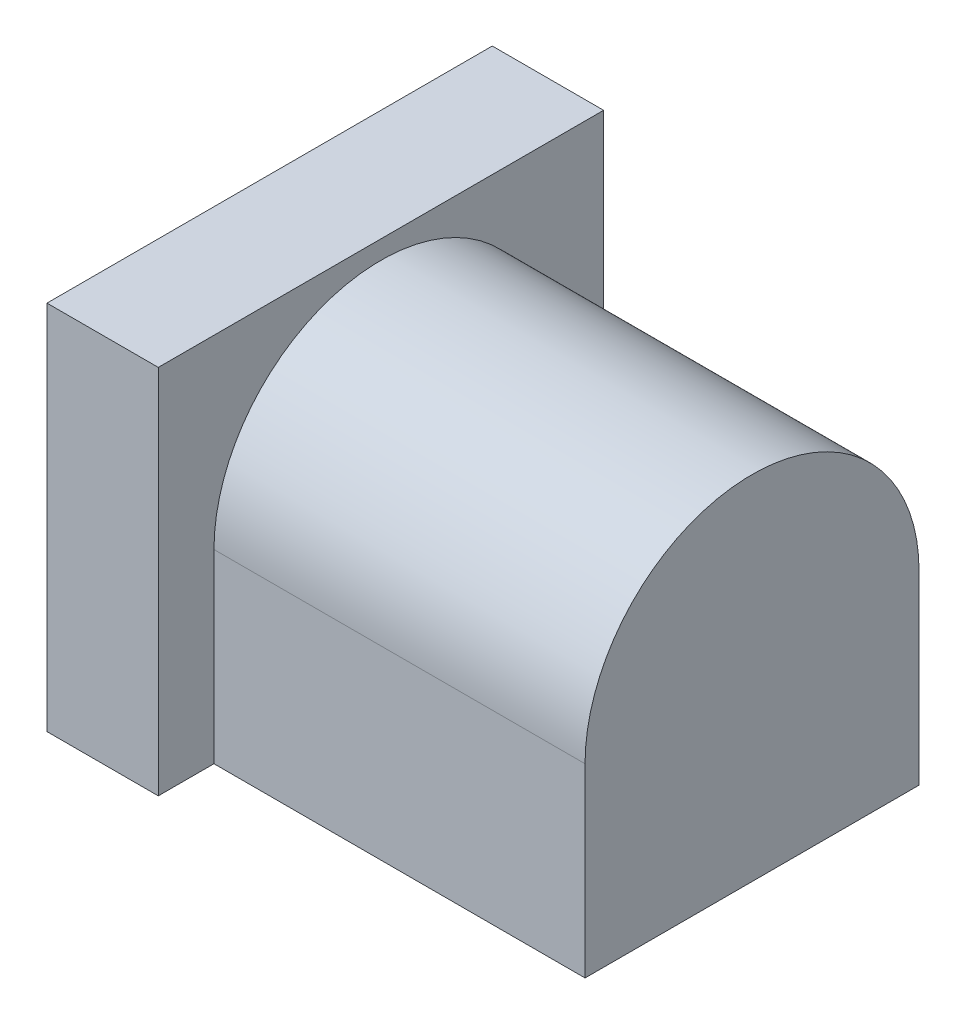
ISO-10303-21;
HEADER;
FILE_DESCRIPTION(('STEP AP214'),'2;1');
FILE_NAME('part.step','',(''),(''),'','','');
FILE_SCHEMA(('AUTOMOTIVE_DESIGN { 1 0 10303 214 1 1 1 1 }'));
ENDSEC;
DATA;
#1=APPLICATION_CONTEXT('core data for automotive mechanical design processes');
#2=APPLICATION_PROTOCOL_DEFINITION('international standard','automotive_design',2000,#1);
#3=PRODUCT_CONTEXT('',#1,'mechanical');
#4=PRODUCT('Part','Part','',(#3));
#5=PRODUCT_RELATED_PRODUCT_CATEGORY('part','',(#4));
#6=PRODUCT_DEFINITION_FORMATION('','',#4);
#7=PRODUCT_DEFINITION_CONTEXT('part definition',#1,'design');
#8=PRODUCT_DEFINITION('design','',#6,#7);
#9=PRODUCT_DEFINITION_SHAPE('','',#8);
#10=(LENGTH_UNIT() NAMED_UNIT(*) SI_UNIT(.MILLI.,.METRE.));
#11=(NAMED_UNIT(*) PLANE_ANGLE_UNIT() SI_UNIT($,.RADIAN.));
#12=(NAMED_UNIT(*) SI_UNIT($,.STERADIAN.) SOLID_ANGLE_UNIT());
#13=UNCERTAINTY_MEASURE_WITH_UNIT(LENGTH_MEASURE(1.E-05),#10,'distance_accuracy_value','');
#14=(GEOMETRIC_REPRESENTATION_CONTEXT(3) GLOBAL_UNCERTAINTY_ASSIGNED_CONTEXT((#13)) GLOBAL_UNIT_ASSIGNED_CONTEXT((#10,
#11,#12)) REPRESENTATION_CONTEXT('',''));
#15=CARTESIAN_POINT('',(0.,0.,0.));
#16=DIRECTION('',(0.,0.,1.));
#17=DIRECTION('',(1.,0.,0.));
#18=AXIS2_PLACEMENT_3D('',#15,#16,#17);
#19=CARTESIAN_POINT('',(9.,-38.179278243511,0.));
#20=DIRECTION('',(-1.,0.,0.));
#21=DIRECTION('',(0.,0.,1.));
#22=AXIS2_PLACEMENT_3D('',#19,#20,#21);
#23=PLANE('',#22);
#24=CARTESIAN_POINT('',(9.,-38.179278243511,0.));
#25=DIRECTION('',(-1.,0.,0.));
#26=DIRECTION('',(0.,0.,1.));
#27=AXIS2_PLACEMENT_3D('',#24,#25,#26);
#28=CIRCLE('',#27,3.);
#29=CARTESIAN_POINT('',(9.,-38.179278243511,2.99999999999999));
#30=VERTEX_POINT('',#29);
#31=EDGE_CURVE('E153',#30,#30,#28,.T.);
#32=ORIENTED_EDGE('',*,*,#31,.T.);
#33=EDGE_LOOP('',(#32));
#34=FACE_BOUND('',#33,.T.);
#35=CARTESIAN_POINT('',(9.,-38.179278243511,0.));
#36=DIRECTION('',(-1.,0.,0.));
#37=DIRECTION('',(0.,0.,1.));
#38=AXIS2_PLACEMENT_3D('',#35,#36,#37);
#39=CIRCLE('',#38,0.5);
#40=CARTESIAN_POINT('',(9.,-38.179278243511,0.49999999999999));
#41=VERTEX_POINT('',#40);
#42=EDGE_CURVE('E160',#41,#41,#39,.T.);
#43=ORIENTED_EDGE('',*,*,#42,.F.);
#44=EDGE_LOOP('',(#43));
#45=FACE_BOUND('',#44,.T.);
#46=ADVANCED_FACE('F34',(#34,#45),#23,.T.);
#47=CARTESIAN_POINT('',(10.,-43.179278243511,4.49999999999998));
#48=DIRECTION('',(0.,0.,-1.));
#49=DIRECTION('',(0.,1.,0.));
#50=AXIS2_PLACEMENT_3D('',#47,#48,#49);
#51=PLANE('',#50);
#52=DIRECTION('',(0.,-1.,0.));
#53=VECTOR('',#52,1.);
#54=CARTESIAN_POINT('',(0.,-43.179278243511,4.49999999999998));
#55=LINE('',#54,#53);
#56=CARTESIAN_POINT('',(0.,-38.179278243511,4.49999999999999));
#57=VERTEX_POINT('',#56);
#58=CARTESIAN_POINT('',(0.,-43.179278243511,4.49999999999999));
#59=VERTEX_POINT('',#58);
#60=EDGE_CURVE('E122',#57,#59,#55,.T.);
#61=ORIENTED_EDGE('',*,*,#60,.T.);
#62=DIRECTION('',(-1.,0.,0.));
#63=VECTOR('',#62,1.);
#64=CARTESIAN_POINT('',(10.,-43.179278243511,4.49999999999998));
#65=LINE('',#64,#63);
#66=CARTESIAN_POINT('',(10.,-43.179278243511,4.49999999999998));
#67=VERTEX_POINT('',#66);
#68=EDGE_CURVE('E43',#67,#59,#65,.T.);
#69=ORIENTED_EDGE('',*,*,#68,.F.);
#70=DIRECTION('',(0.,-1.,0.));
#71=VECTOR('',#70,1.);
#72=CARTESIAN_POINT('',(10.,-43.179278243511,4.49999999999998));
#73=LINE('',#72,#71);
#74=CARTESIAN_POINT('',(10.,-38.179278243511,4.49999999999999));
#75=VERTEX_POINT('',#74);
#76=EDGE_CURVE('E329',#75,#67,#73,.T.);
#77=ORIENTED_EDGE('',*,*,#76,.F.);
#78=DIRECTION('',(-1.,0.,0.));
#79=VECTOR('',#78,1.);
#80=CARTESIAN_POINT('',(10.,-38.179278243511,4.49999999999999));
#81=LINE('',#80,#79);
#82=EDGE_CURVE('E313',#75,#57,#81,.T.);
#83=ORIENTED_EDGE('',*,*,#82,.T.);
#84=EDGE_LOOP('',(#61,#69,#77,#83));
#85=FACE_BOUND('',#84,.T.);
#86=ADVANCED_FACE('F174',(#85),#51,.F.);
#87=CARTESIAN_POINT('',(10.,-43.179278243511,4.49999999999998));
#88=DIRECTION('',(0.,1.,0.));
#89=DIRECTION('',(0.,0.,1.));
#90=AXIS2_PLACEMENT_3D('',#87,#88,#89);
#91=PLANE('',#90);
#92=ORIENTED_EDGE('',*,*,#68,.T.);
#93=DIRECTION('',(0.,0.,1.));
#94=VECTOR('',#93,1.);
#95=CARTESIAN_POINT('',(0.,-43.179278243511,-6.));
#96=LINE('',#95,#94);
#97=CARTESIAN_POINT('',(0.,-43.179278243511,6.));
#98=VERTEX_POINT('',#97);
#99=EDGE_CURVE('E134',#59,#98,#96,.T.);
#100=ORIENTED_EDGE('',*,*,#99,.T.);
#101=DIRECTION('',(1.,0.,0.));
#102=VECTOR('',#101,1.);
#103=CARTESIAN_POINT('',(-3.,-43.179278243511,6.));
#104=LINE('',#103,#102);
#105=CARTESIAN_POINT('',(-3.,-43.179278243511,6.));
#106=VERTEX_POINT('',#105);
#107=EDGE_CURVE('E104',#106,#98,#104,.T.);
#108=ORIENTED_EDGE('',*,*,#107,.F.);
#109=DIRECTION('',(0.,0.,1.));
#110=VECTOR('',#109,1.);
#111=CARTESIAN_POINT('',(-3.,-43.179278243511,-6.));
#112=LINE('',#111,#110);
#113=CARTESIAN_POINT('',(-3.,-43.179278243511,-6.));
#114=VERTEX_POINT('',#113);
#115=EDGE_CURVE('E95',#114,#106,#112,.T.);
#116=ORIENTED_EDGE('',*,*,#115,.F.);
#117=DIRECTION('',(1.,0.,0.));
#118=VECTOR('',#117,1.);
#119=CARTESIAN_POINT('',(-3.,-43.179278243511,-6.));
#120=LINE('',#119,#118);
#121=CARTESIAN_POINT('',(0.,-43.179278243511,-6.));
#122=VERTEX_POINT('',#121);
#123=EDGE_CURVE('E101',#114,#122,#120,.T.);
#124=ORIENTED_EDGE('',*,*,#123,.T.);
#125=CARTESIAN_POINT('',(0.,-43.179278243511,-4.50000000000001));
#126=VERTEX_POINT('',#125);
#127=EDGE_CURVE('E130',#122,#126,#96,.T.);
#128=ORIENTED_EDGE('',*,*,#127,.T.);
#129=DIRECTION('',(-1.,0.,0.));
#130=VECTOR('',#129,1.);
#131=CARTESIAN_POINT('',(10.,-43.179278243511,-4.5));
#132=LINE('',#131,#130);
#133=CARTESIAN_POINT('',(10.,-43.179278243511,-4.5));
#134=VERTEX_POINT('',#133);
#135=EDGE_CURVE('E307',#134,#126,#132,.T.);
#136=ORIENTED_EDGE('',*,*,#135,.F.);
#137=DIRECTION('',(0.,0.,-1.));
#138=VECTOR('',#137,1.);
#139=CARTESIAN_POINT('',(10.,-43.179278243511,4.49999999999998));
#140=LINE('',#139,#138);
#141=EDGE_CURVE('E330',#67,#134,#140,.T.);
#142=ORIENTED_EDGE('',*,*,#141,.F.);
#143=EDGE_LOOP('',(#92,#100,#108,#116,#124,#128,#136,#142));
#144=FACE_BOUND('',#143,.T.);
#145=ADVANCED_FACE('F98',(#144),#91,.F.);
#146=CARTESIAN_POINT('',(10.,-43.179278243511,-4.5));
#147=DIRECTION('',(0.,0.,1.));
#148=DIRECTION('',(0.,-1.,0.));
#149=AXIS2_PLACEMENT_3D('',#146,#147,#148);
#150=PLANE('',#149);
#151=DIRECTION('',(0.,1.,0.));
#152=VECTOR('',#151,1.);
#153=CARTESIAN_POINT('',(0.,-43.179278243511,-4.5));
#154=LINE('',#153,#152);
#155=CARTESIAN_POINT('',(0.,-38.179278243511,-4.50000000000001));
#156=VERTEX_POINT('',#155);
#157=EDGE_CURVE('E125',#126,#156,#154,.T.);
#158=ORIENTED_EDGE('',*,*,#157,.T.);
#159=DIRECTION('',(-1.,0.,0.));
#160=VECTOR('',#159,1.);
#161=CARTESIAN_POINT('',(10.,-38.179278243511,-4.50000000000001));
#162=LINE('',#161,#160);
#163=CARTESIAN_POINT('',(10.,-38.179278243511,-4.50000000000001));
#164=VERTEX_POINT('',#163);
#165=EDGE_CURVE('E305',#164,#156,#162,.T.);
#166=ORIENTED_EDGE('',*,*,#165,.F.);
#167=DIRECTION('',(0.,1.,0.));
#168=VECTOR('',#167,1.);
#169=CARTESIAN_POINT('',(10.,-43.179278243511,-4.5));
#170=LINE('',#169,#168);
#171=EDGE_CURVE('E333',#134,#164,#170,.T.);
#172=ORIENTED_EDGE('',*,*,#171,.F.);
#173=ORIENTED_EDGE('',*,*,#135,.T.);
#174=EDGE_LOOP('',(#158,#166,#172,#173));
#175=FACE_BOUND('',#174,.T.);
#176=ADVANCED_FACE('F201',(#175),#150,.F.);
#177=CARTESIAN_POINT('',(10.,-38.179278243511,0.));
#178=DIRECTION('',(-1.,0.,0.));
#179=DIRECTION('',(0.,0.,1.));
#180=AXIS2_PLACEMENT_3D('',#177,#178,#179);
#181=CYLINDRICAL_SURFACE('',#180,4.5);
#182=CARTESIAN_POINT('',(0.,-38.179278243511,0.));
#183=DIRECTION('',(1.,0.,0.));
#184=DIRECTION('',(0.,0.,1.));
#185=AXIS2_PLACEMENT_3D('',#182,#183,#184);
#186=CIRCLE('',#185,4.5);
#187=EDGE_CURVE('E309',#156,#57,#186,.T.);
#188=ORIENTED_EDGE('',*,*,#187,.T.);
#189=ORIENTED_EDGE('',*,*,#82,.F.);
#190=CARTESIAN_POINT('',(10.,-38.179278243511,0.));
#191=DIRECTION('',(1.,0.,0.));
#192=DIRECTION('',(0.,0.,1.));
#193=AXIS2_PLACEMENT_3D('',#190,#191,#192);
#194=CIRCLE('',#193,4.5);
#195=EDGE_CURVE('E50',#164,#75,#194,.T.);
#196=ORIENTED_EDGE('',*,*,#195,.F.);
#197=ORIENTED_EDGE('',*,*,#165,.T.);
#198=EDGE_LOOP('',(#188,#189,#196,#197));
#199=FACE_BOUND('',#198,.T.);
#200=ADVANCED_FACE('F196',(#199),#181,.T.);
#201=CARTESIAN_POINT('',(10.,-38.179278243511,0.));
#202=DIRECTION('',(-1.,0.,0.));
#203=DIRECTION('',(0.,0.,1.));
#204=AXIS2_PLACEMENT_3D('',#201,#202,#203);
#205=PLANE('',#204);
#206=ORIENTED_EDGE('',*,*,#76,.T.);
#207=ORIENTED_EDGE('',*,*,#141,.T.);
#208=ORIENTED_EDGE('',*,*,#171,.T.);
#209=ORIENTED_EDGE('',*,*,#195,.T.);
#210=EDGE_LOOP('',(#206,#207,#208,#209));
#211=FACE_BOUND('',#210,.T.);
#212=ADVANCED_FACE('F192',(#211),#205,.F.);
#213=CARTESIAN_POINT('',(0.,0.,0.));
#214=DIRECTION('',(1.,0.,0.));
#215=DIRECTION('',(0.,0.,-1.));
#216=AXIS2_PLACEMENT_3D('',#213,#214,#215);
#217=PLANE('',#216);
#218=ORIENTED_EDGE('',*,*,#60,.F.);
#219=ORIENTED_EDGE('',*,*,#187,.F.);
#220=ORIENTED_EDGE('',*,*,#157,.F.);
#221=ORIENTED_EDGE('',*,*,#127,.F.);
#222=DIRECTION('',(0.,-1.,0.));
#223=VECTOR('',#222,1.);
#224=CARTESIAN_POINT('',(0.,-43.179278243511,-6.));
#225=LINE('',#224,#223);
#226=CARTESIAN_POINT('',(0.,-33.179278243511,-6.));
#227=VERTEX_POINT('',#226);
#228=EDGE_CURVE('E121',#227,#122,#225,.T.);
#229=ORIENTED_EDGE('',*,*,#228,.F.);
#230=DIRECTION('',(0.,0.,-1.));
#231=VECTOR('',#230,1.);
#232=CARTESIAN_POINT('',(0.,-33.179278243511,-6.));
#233=LINE('',#232,#231);
#234=CARTESIAN_POINT('',(0.,-33.179278243511,6.));
#235=VERTEX_POINT('',#234);
#236=EDGE_CURVE('E117',#235,#227,#233,.T.);
#237=ORIENTED_EDGE('',*,*,#236,.F.);
#238=DIRECTION('',(0.,1.,0.));
#239=VECTOR('',#238,1.);
#240=CARTESIAN_POINT('',(0.,-43.179278243511,6.));
#241=LINE('',#240,#239);
#242=EDGE_CURVE('E133',#98,#235,#241,.T.);
#243=ORIENTED_EDGE('',*,*,#242,.F.);
#244=ORIENTED_EDGE('',*,*,#99,.F.);
#245=EDGE_LOOP('',(#218,#219,#220,#221,#229,#237,#243,#244));
#246=FACE_BOUND('',#245,.T.);
#247=ADVANCED_FACE('F152',(#246),#217,.T.);
#248=CARTESIAN_POINT('',(-3.,-43.179278243511,-6.));
#249=DIRECTION('',(0.,0.,1.));
#250=DIRECTION('',(1.,0.,0.));
#251=AXIS2_PLACEMENT_3D('',#248,#249,#250);
#252=PLANE('',#251);
#253=ORIENTED_EDGE('',*,*,#228,.T.);
#254=ORIENTED_EDGE('',*,*,#123,.F.);
#255=DIRECTION('',(0.,-1.,0.));
#256=VECTOR('',#255,1.);
#257=CARTESIAN_POINT('',(-3.,-43.179278243511,-6.));
#258=LINE('',#257,#256);
#259=CARTESIAN_POINT('',(-3.,-33.179278243511,-6.));
#260=VERTEX_POINT('',#259);
#261=EDGE_CURVE('E108',#260,#114,#258,.T.);
#262=ORIENTED_EDGE('',*,*,#261,.F.);
#263=DIRECTION('',(1.,0.,0.));
#264=VECTOR('',#263,1.);
#265=CARTESIAN_POINT('',(-3.,-33.179278243511,-6.));
#266=LINE('',#265,#264);
#267=EDGE_CURVE('E143',#260,#227,#266,.T.);
#268=ORIENTED_EDGE('',*,*,#267,.T.);
#269=EDGE_LOOP('',(#253,#254,#262,#268));
#270=FACE_BOUND('',#269,.T.);
#271=ADVANCED_FACE('F119',(#270),#252,.F.);
#272=CARTESIAN_POINT('',(-3.,-43.179278243511,6.));
#273=DIRECTION('',(0.,0.,-1.));
#274=DIRECTION('',(0.,1.,0.));
#275=AXIS2_PLACEMENT_3D('',#272,#273,#274);
#276=PLANE('',#275);
#277=ORIENTED_EDGE('',*,*,#242,.T.);
#278=DIRECTION('',(1.,0.,0.));
#279=VECTOR('',#278,1.);
#280=CARTESIAN_POINT('',(-3.,-33.179278243511,6.));
#281=LINE('',#280,#279);
#282=CARTESIAN_POINT('',(-3.,-33.179278243511,6.));
#283=VERTEX_POINT('',#282);
#284=EDGE_CURVE('E126',#283,#235,#281,.T.);
#285=ORIENTED_EDGE('',*,*,#284,.F.);
#286=DIRECTION('',(0.,1.,0.));
#287=VECTOR('',#286,1.);
#288=CARTESIAN_POINT('',(-3.,-43.179278243511,6.));
#289=LINE('',#288,#287);
#290=EDGE_CURVE('E107',#106,#283,#289,.T.);
#291=ORIENTED_EDGE('',*,*,#290,.F.);
#292=ORIENTED_EDGE('',*,*,#107,.T.);
#293=EDGE_LOOP('',(#277,#285,#291,#292));
#294=FACE_BOUND('',#293,.T.);
#295=ADVANCED_FACE('F164',(#294),#276,.F.);
#296=CARTESIAN_POINT('',(-3.,-33.179278243511,-6.));
#297=DIRECTION('',(0.,-1.,0.));
#298=DIRECTION('',(0.,0.,-1.));
#299=AXIS2_PLACEMENT_3D('',#296,#297,#298);
#300=PLANE('',#299);
#301=ORIENTED_EDGE('',*,*,#236,.T.);
#302=ORIENTED_EDGE('',*,*,#267,.F.);
#303=DIRECTION('',(0.,0.,-1.));
#304=VECTOR('',#303,1.);
#305=CARTESIAN_POINT('',(-3.,-33.179278243511,-6.));
#306=LINE('',#305,#304);
#307=EDGE_CURVE('E113',#283,#260,#306,.T.);
#308=ORIENTED_EDGE('',*,*,#307,.F.);
#309=ORIENTED_EDGE('',*,*,#284,.T.);
#310=EDGE_LOOP('',(#301,#302,#308,#309));
#311=FACE_BOUND('',#310,.T.);
#312=ADVANCED_FACE('F148',(#311),#300,.F.);
#313=CARTESIAN_POINT('',(-3.,0.,0.));
#314=DIRECTION('',(1.,0.,0.));
#315=DIRECTION('',(0.,0.,-1.));
#316=AXIS2_PLACEMENT_3D('',#313,#314,#315);
#317=PLANE('',#316);
#318=CARTESIAN_POINT('',(-3.,-38.179278243511,0.));
#319=DIRECTION('',(-1.,0.,0.));
#320=DIRECTION('',(0.,0.,1.));
#321=AXIS2_PLACEMENT_3D('',#318,#319,#320);
#322=CIRCLE('',#321,3.);
#323=CARTESIAN_POINT('',(-3.,-38.179278243511,2.99999999999999));
#324=VERTEX_POINT('',#323);
#325=EDGE_CURVE('E155',#324,#324,#322,.T.);
#326=ORIENTED_EDGE('',*,*,#325,.F.);
#327=EDGE_LOOP('',(#326));
#328=FACE_BOUND('',#327,.T.);
#329=ORIENTED_EDGE('',*,*,#261,.T.);
#330=ORIENTED_EDGE('',*,*,#115,.T.);
#331=ORIENTED_EDGE('',*,*,#290,.T.);
#332=ORIENTED_EDGE('',*,*,#307,.T.);
#333=EDGE_LOOP('',(#329,#330,#331,#332));
#334=FACE_BOUND('',#333,.T.);
#335=ADVANCED_FACE('F111',(#328,#334),#317,.F.);
#336=CARTESIAN_POINT('',(9.,-38.179278243511,0.));
#337=DIRECTION('',(-1.,0.,0.));
#338=DIRECTION('',(0.,0.,1.));
#339=AXIS2_PLACEMENT_3D('',#336,#337,#338);
#340=CYLINDRICAL_SURFACE('',#339,3.);
#341=ORIENTED_EDGE('',*,*,#31,.F.);
#342=EDGE_LOOP('',(#341));
#343=FACE_BOUND('',#342,.T.);
#344=ORIENTED_EDGE('',*,*,#325,.T.);
#345=EDGE_LOOP('',(#344));
#346=FACE_BOUND('',#345,.T.);
#347=ADVANCED_FACE('F184',(#343,#346),#340,.F.);
#348=CARTESIAN_POINT('',(-0.999999999999999,-38.179278243511,0.));
#349=DIRECTION('',(1.,0.,0.));
#350=DIRECTION('',(0.,0.,-1.));
#351=AXIS2_PLACEMENT_3D('',#348,#349,#350);
#352=CYLINDRICAL_SURFACE('',#351,0.5);
#353=CARTESIAN_POINT('',(-0.499999999999999,-38.179278243511,0.));
#354=DIRECTION('',(1.,0.,0.));
#355=DIRECTION('',(0.,0.,-1.));
#356=AXIS2_PLACEMENT_3D('',#353,#354,#355);
#357=CIRCLE('',#356,0.5);
#358=CARTESIAN_POINT('',(-0.499999999999999,-38.179278243511,-0.500000000000011));
#359=VERTEX_POINT('',#358);
#360=EDGE_CURVE('E11',#359,#359,#357,.T.);
#361=ORIENTED_EDGE('',*,*,#360,.T.);
#362=EDGE_LOOP('',(#361));
#363=FACE_BOUND('',#362,.T.);
#364=ORIENTED_EDGE('',*,*,#42,.T.);
#365=EDGE_LOOP('',(#364));
#366=FACE_BOUND('',#365,.T.);
#367=ADVANCED_FACE('F183',(#363,#366),#352,.T.);
#368=CARTESIAN_POINT('',(-0.499999999999999,-38.179278243511,0.));
#369=DIRECTION('',(0.,0.,1.));
#370=DIRECTION('',(1.,0.,0.));
#371=AXIS2_PLACEMENT_3D('',#368,#369,#370);
#372=SPHERICAL_SURFACE('',#371,0.5);
#373=CARTESIAN_POINT('',(-0.499999999999999,-38.179278243511,0.));
#374=DIRECTION('',(1.,0.,0.));
#375=DIRECTION('',(0.,0.,-1.));
#376=AXIS2_PLACEMENT_3D('',#373,#374,#375);
#377=SPHERICAL_SURFACE('',#376,0.5);
#378=ORIENTED_EDGE('',*,*,#360,.F.);
#379=EDGE_LOOP('',(#378));
#380=FACE_BOUND('',#379,.T.);
#381=ADVANCED_FACE('F36',(#380),#377,.T.);
#382=CLOSED_SHELL('',(#46,#86,#145,#176,#200,#212,#247,#271,#295,#312,#335,#347,#367,#381));
#383=MANIFOLD_SOLID_BREP('B2',#382);
#384=ADVANCED_BREP_SHAPE_REPRESENTATION('',(#18,#383),#14);
#385=SHAPE_DEFINITION_REPRESENTATION(#9,#384);
ENDSEC;
END-ISO-10303-21;
